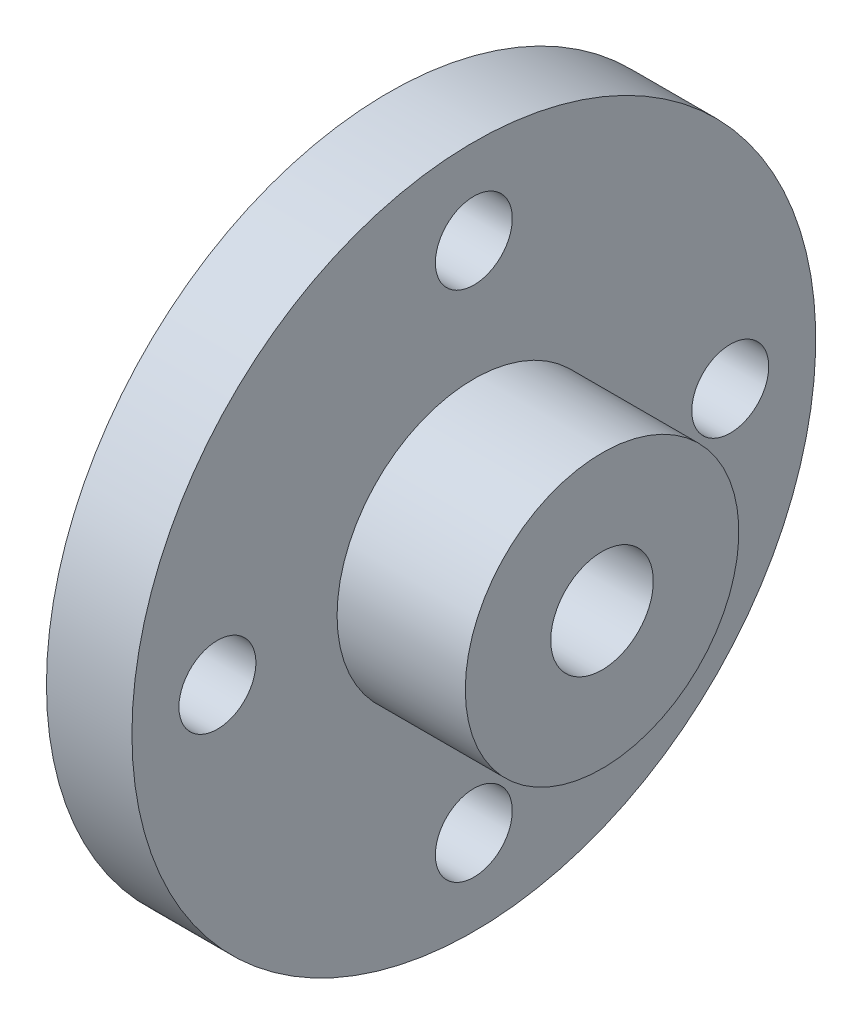
ISO-10303-21;
HEADER;
FILE_DESCRIPTION(('STEP AP214'),'2;1');
FILE_NAME('part.step','',(''),(''),'','','');
FILE_SCHEMA(('AUTOMOTIVE_DESIGN { 1 0 10303 214 1 1 1 1 }'));
ENDSEC;
DATA;
#1=APPLICATION_CONTEXT('core data for automotive mechanical design processes');
#2=APPLICATION_PROTOCOL_DEFINITION('international standard','automotive_design',2000,#1);
#3=PRODUCT_CONTEXT('',#1,'mechanical');
#4=PRODUCT('Part','Part','',(#3));
#5=PRODUCT_RELATED_PRODUCT_CATEGORY('part','',(#4));
#6=PRODUCT_DEFINITION_FORMATION('','',#4);
#7=PRODUCT_DEFINITION_CONTEXT('part definition',#1,'design');
#8=PRODUCT_DEFINITION('design','',#6,#7);
#9=PRODUCT_DEFINITION_SHAPE('','',#8);
#10=(LENGTH_UNIT() NAMED_UNIT(*) SI_UNIT(.MILLI.,.METRE.));
#11=(NAMED_UNIT(*) PLANE_ANGLE_UNIT() SI_UNIT($,.RADIAN.));
#12=(NAMED_UNIT(*) SI_UNIT($,.STERADIAN.) SOLID_ANGLE_UNIT());
#13=UNCERTAINTY_MEASURE_WITH_UNIT(LENGTH_MEASURE(1.E-05),#10,'distance_accuracy_value','');
#14=(GEOMETRIC_REPRESENTATION_CONTEXT(3) GLOBAL_UNCERTAINTY_ASSIGNED_CONTEXT((#13)) GLOBAL_UNIT_ASSIGNED_CONTEXT((#10,
#11,#12)) REPRESENTATION_CONTEXT('',''));
#15=CARTESIAN_POINT('',(0.,0.,0.));
#16=DIRECTION('',(0.,0.,1.));
#17=DIRECTION('',(1.,0.,0.));
#18=AXIS2_PLACEMENT_3D('',#15,#16,#17);
#19=CARTESIAN_POINT('',(-16.9594650205761,0.,0.));
#20=DIRECTION('',(-1.,0.,0.));
#21=DIRECTION('',(0.,0.,1.));
#22=AXIS2_PLACEMENT_3D('',#19,#20,#21);
#23=CYLINDRICAL_SURFACE('',#22,16.);
#24=CARTESIAN_POINT('',(0.,0.,0.));
#25=DIRECTION('',(-1.,0.,0.));
#26=DIRECTION('',(0.,0.,1.));
#27=AXIS2_PLACEMENT_3D('',#24,#25,#26);
#28=CIRCLE('',#27,16.);
#29=CARTESIAN_POINT('',(0.,0.,16.));
#30=VERTEX_POINT('',#29);
#31=EDGE_CURVE('E17',#30,#30,#28,.F.);
#32=ORIENTED_EDGE('',*,*,#31,.T.);
#33=EDGE_LOOP('',(#32));
#34=FACE_BOUND('',#33,.T.);
#35=CARTESIAN_POINT('',(15.,0.,0.));
#36=DIRECTION('',(-1.,0.,0.));
#37=DIRECTION('',(0.,0.,1.));
#38=AXIS2_PLACEMENT_3D('',#35,#36,#37);
#39=CIRCLE('',#38,16.);
#40=CARTESIAN_POINT('',(15.,0.,16.));
#41=VERTEX_POINT('',#40);
#42=EDGE_CURVE('E57',#41,#41,#39,.T.);
#43=ORIENTED_EDGE('',*,*,#42,.T.);
#44=EDGE_LOOP('',(#43));
#45=FACE_BOUND('',#44,.T.);
#46=ADVANCED_FACE('F14',(#34,#45),#23,.T.);
#47=CARTESIAN_POINT('',(0.,40.,0.));
#48=DIRECTION('',(-1.,0.,0.));
#49=DIRECTION('',(0.,0.,1.));
#50=AXIS2_PLACEMENT_3D('',#47,#48,#49);
#51=PLANE('',#50);
#52=CARTESIAN_POINT('',(0.,3.14233320495882E-13,-30.));
#53=DIRECTION('',(-1.,0.,0.));
#54=DIRECTION('',(0.,0.,1.));
#55=AXIS2_PLACEMENT_3D('',#52,#53,#54);
#56=CIRCLE('',#55,4.5);
#57=CARTESIAN_POINT('',(0.,3.14233320495882E-13,-25.5));
#58=VERTEX_POINT('',#57);
#59=EDGE_CURVE('E55',#58,#58,#56,.T.);
#60=ORIENTED_EDGE('',*,*,#59,.T.);
#61=EDGE_LOOP('',(#60));
#62=FACE_BOUND('',#61,.T.);
#63=CARTESIAN_POINT('',(0.,-1.04744440165294E-13,30.));
#64=DIRECTION('',(-1.,0.,0.));
#65=DIRECTION('',(0.,0.,1.));
#66=AXIS2_PLACEMENT_3D('',#63,#64,#65);
#67=CIRCLE('',#66,4.5);
#68=CARTESIAN_POINT('',(0.,-1.04744440165294E-13,34.5));
#69=VERTEX_POINT('',#68);
#70=EDGE_CURVE('E52',#69,#69,#67,.T.);
#71=ORIENTED_EDGE('',*,*,#70,.T.);
#72=EDGE_LOOP('',(#71));
#73=FACE_BOUND('',#72,.T.);
#74=ORIENTED_EDGE('',*,*,#31,.F.);
#75=EDGE_LOOP('',(#74));
#76=FACE_BOUND('',#75,.T.);
#77=CARTESIAN_POINT('',(0.,0.,0.));
#78=DIRECTION('',(-1.,0.,0.));
#79=DIRECTION('',(0.,0.,1.));
#80=AXIS2_PLACEMENT_3D('',#77,#78,#79);
#81=CIRCLE('',#80,40.);
#82=CARTESIAN_POINT('',(0.,0.,40.));
#83=VERTEX_POINT('',#82);
#84=EDGE_CURVE('E49',#83,#83,#81,.T.);
#85=ORIENTED_EDGE('',*,*,#84,.F.);
#86=EDGE_LOOP('',(#85));
#87=FACE_BOUND('',#86,.T.);
#88=CARTESIAN_POINT('',(0.,30.,0.));
#89=DIRECTION('',(-1.,0.,0.));
#90=DIRECTION('',(0.,0.,1.));
#91=AXIS2_PLACEMENT_3D('',#88,#89,#90);
#92=CIRCLE('',#91,4.5);
#93=CARTESIAN_POINT('',(0.,30.,4.5));
#94=VERTEX_POINT('',#93);
#95=EDGE_CURVE('E46',#94,#94,#92,.T.);
#96=ORIENTED_EDGE('',*,*,#95,.T.);
#97=EDGE_LOOP('',(#96));
#98=FACE_BOUND('',#97,.T.);
#99=CARTESIAN_POINT('',(0.,-30.,-2.09488880330588E-13));
#100=DIRECTION('',(-1.,0.,0.));
#101=DIRECTION('',(0.,0.,1.));
#102=AXIS2_PLACEMENT_3D('',#99,#100,#101);
#103=CIRCLE('',#102,4.5);
#104=CARTESIAN_POINT('',(0.,-30.,4.49999999999979));
#105=VERTEX_POINT('',#104);
#106=EDGE_CURVE('E43',#105,#105,#103,.T.);
#107=ORIENTED_EDGE('',*,*,#106,.T.);
#108=EDGE_LOOP('',(#107));
#109=FACE_BOUND('',#108,.T.);
#110=ADVANCED_FACE('F65',(#62,#73,#76,#87,#98,#109),#51,.F.);
#111=CARTESIAN_POINT('',(15.,16.,0.));
#112=DIRECTION('',(-1.,0.,0.));
#113=DIRECTION('',(0.,0.,1.));
#114=AXIS2_PLACEMENT_3D('',#111,#112,#113);
#115=PLANE('',#114);
#116=CARTESIAN_POINT('',(15.,0.,0.));
#117=DIRECTION('',(-1.,0.,0.));
#118=DIRECTION('',(0.,0.,1.));
#119=AXIS2_PLACEMENT_3D('',#116,#117,#118);
#120=CIRCLE('',#119,6.);
#121=CARTESIAN_POINT('',(15.,0.,6.));
#122=VERTEX_POINT('',#121);
#123=EDGE_CURVE('E40',#122,#122,#120,.T.);
#124=ORIENTED_EDGE('',*,*,#123,.T.);
#125=EDGE_LOOP('',(#124));
#126=FACE_BOUND('',#125,.T.);
#127=ORIENTED_EDGE('',*,*,#42,.F.);
#128=EDGE_LOOP('',(#127));
#129=FACE_BOUND('',#128,.T.);
#130=ADVANCED_FACE('F68',(#126,#129),#115,.F.);
#131=CARTESIAN_POINT('',(15.,3.14233320495882E-13,-30.));
#132=DIRECTION('',(-1.,0.,0.));
#133=DIRECTION('',(0.,0.,1.));
#134=AXIS2_PLACEMENT_3D('',#131,#132,#133);
#135=CYLINDRICAL_SURFACE('',#134,4.5);
#136=CARTESIAN_POINT('',(-9.99999999999999,3.14233320495882E-13,-30.));
#137=DIRECTION('',(-1.,0.,0.));
#138=DIRECTION('',(0.,0.,1.));
#139=AXIS2_PLACEMENT_3D('',#136,#137,#138);
#140=CIRCLE('',#139,4.5);
#141=CARTESIAN_POINT('',(-9.99999999999999,3.14233320495882E-13,-25.5));
#142=VERTEX_POINT('',#141);
#143=EDGE_CURVE('E37',#142,#142,#140,.T.);
#144=ORIENTED_EDGE('',*,*,#143,.T.);
#145=EDGE_LOOP('',(#144));
#146=FACE_BOUND('',#145,.T.);
#147=ORIENTED_EDGE('',*,*,#59,.F.);
#148=EDGE_LOOP('',(#147));
#149=FACE_BOUND('',#148,.T.);
#150=ADVANCED_FACE('F109',(#146,#149),#135,.F.);
#151=CARTESIAN_POINT('',(15.,-1.04744440165294E-13,30.));
#152=DIRECTION('',(-1.,0.,0.));
#153=DIRECTION('',(0.,0.,1.));
#154=AXIS2_PLACEMENT_3D('',#151,#152,#153);
#155=CYLINDRICAL_SURFACE('',#154,4.5);
#156=CARTESIAN_POINT('',(-9.99999999999999,-1.04744440165294E-13,30.));
#157=DIRECTION('',(-1.,0.,0.));
#158=DIRECTION('',(0.,0.,1.));
#159=AXIS2_PLACEMENT_3D('',#156,#157,#158);
#160=CIRCLE('',#159,4.5);
#161=CARTESIAN_POINT('',(-9.99999999999999,-1.04744440165294E-13,34.5));
#162=VERTEX_POINT('',#161);
#163=EDGE_CURVE('E34',#162,#162,#160,.T.);
#164=ORIENTED_EDGE('',*,*,#163,.T.);
#165=EDGE_LOOP('',(#164));
#166=FACE_BOUND('',#165,.T.);
#167=ORIENTED_EDGE('',*,*,#70,.F.);
#168=EDGE_LOOP('',(#167));
#169=FACE_BOUND('',#168,.T.);
#170=ADVANCED_FACE('F112',(#166,#169),#155,.F.);
#171=CARTESIAN_POINT('',(-16.9594650205761,0.,0.));
#172=DIRECTION('',(-1.,0.,0.));
#173=DIRECTION('',(0.,0.,1.));
#174=AXIS2_PLACEMENT_3D('',#171,#172,#173);
#175=CYLINDRICAL_SURFACE('',#174,40.);
#176=CARTESIAN_POINT('',(-9.99999999999999,0.,0.));
#177=DIRECTION('',(-1.,0.,0.));
#178=DIRECTION('',(0.,0.,1.));
#179=AXIS2_PLACEMENT_3D('',#176,#177,#178);
#180=CIRCLE('',#179,40.);
#181=CARTESIAN_POINT('',(-9.99999999999999,0.,40.));
#182=VERTEX_POINT('',#181);
#183=EDGE_CURVE('E31',#182,#182,#180,.F.);
#184=ORIENTED_EDGE('',*,*,#183,.T.);
#185=EDGE_LOOP('',(#184));
#186=FACE_BOUND('',#185,.T.);
#187=ORIENTED_EDGE('',*,*,#84,.T.);
#188=EDGE_LOOP('',(#187));
#189=FACE_BOUND('',#188,.T.);
#190=ADVANCED_FACE('F90',(#186,#189),#175,.T.);
#191=CARTESIAN_POINT('',(15.,30.,0.));
#192=DIRECTION('',(-1.,0.,0.));
#193=DIRECTION('',(0.,0.,1.));
#194=AXIS2_PLACEMENT_3D('',#191,#192,#193);
#195=CYLINDRICAL_SURFACE('',#194,4.5);
#196=CARTESIAN_POINT('',(-9.99999999999999,30.,0.));
#197=DIRECTION('',(-1.,0.,0.));
#198=DIRECTION('',(0.,0.,1.));
#199=AXIS2_PLACEMENT_3D('',#196,#197,#198);
#200=CIRCLE('',#199,4.5);
#201=CARTESIAN_POINT('',(-9.99999999999999,30.,4.5));
#202=VERTEX_POINT('',#201);
#203=EDGE_CURVE('E26',#202,#202,#200,.T.);
#204=ORIENTED_EDGE('',*,*,#203,.T.);
#205=EDGE_LOOP('',(#204));
#206=FACE_BOUND('',#205,.T.);
#207=ORIENTED_EDGE('',*,*,#95,.F.);
#208=EDGE_LOOP('',(#207));
#209=FACE_BOUND('',#208,.T.);
#210=ADVANCED_FACE('F79',(#206,#209),#195,.F.);
#211=CARTESIAN_POINT('',(15.,-30.,-2.09488880330588E-13));
#212=DIRECTION('',(-1.,0.,0.));
#213=DIRECTION('',(0.,0.,1.));
#214=AXIS2_PLACEMENT_3D('',#211,#212,#213);
#215=CYLINDRICAL_SURFACE('',#214,4.5);
#216=CARTESIAN_POINT('',(-9.99999999999999,-30.,-2.09488880330588E-13));
#217=DIRECTION('',(-1.,0.,0.));
#218=DIRECTION('',(0.,0.,1.));
#219=AXIS2_PLACEMENT_3D('',#216,#217,#218);
#220=CIRCLE('',#219,4.5);
#221=CARTESIAN_POINT('',(-9.99999999999999,-30.,4.49999999999979));
#222=VERTEX_POINT('',#221);
#223=EDGE_CURVE('E21',#222,#222,#220,.T.);
#224=ORIENTED_EDGE('',*,*,#223,.T.);
#225=EDGE_LOOP('',(#224));
#226=FACE_BOUND('',#225,.T.);
#227=ORIENTED_EDGE('',*,*,#106,.F.);
#228=EDGE_LOOP('',(#227));
#229=FACE_BOUND('',#228,.T.);
#230=ADVANCED_FACE('F76',(#226,#229),#215,.F.);
#231=CARTESIAN_POINT('',(-9.48503389009925,0.,0.));
#232=DIRECTION('',(-1.,0.,0.));
#233=DIRECTION('',(0.,0.,1.));
#234=AXIS2_PLACEMENT_3D('',#231,#232,#233);
#235=CYLINDRICAL_SURFACE('',#234,6.);
#236=ORIENTED_EDGE('',*,*,#123,.F.);
#237=EDGE_LOOP('',(#236));
#238=FACE_BOUND('',#237,.T.);
#239=CARTESIAN_POINT('',(-9.99999999999999,0.,0.));
#240=DIRECTION('',(-1.,0.,0.));
#241=DIRECTION('',(0.,0.,1.));
#242=AXIS2_PLACEMENT_3D('',#239,#240,#241);
#243=CIRCLE('',#242,6.);
#244=CARTESIAN_POINT('',(-9.99999999999999,0.,6.));
#245=VERTEX_POINT('',#244);
#246=EDGE_CURVE('E10',#245,#245,#243,.T.);
#247=ORIENTED_EDGE('',*,*,#246,.T.);
#248=EDGE_LOOP('',(#247));
#249=FACE_BOUND('',#248,.T.);
#250=ADVANCED_FACE('F78',(#238,#249),#235,.F.);
#251=CARTESIAN_POINT('',(-9.99999999999999,0.,0.));
#252=DIRECTION('',(1.,0.,0.));
#253=DIRECTION('',(0.,0.,-1.));
#254=AXIS2_PLACEMENT_3D('',#251,#252,#253);
#255=PLANE('',#254);
#256=ORIENTED_EDGE('',*,*,#246,.F.);
#257=EDGE_LOOP('',(#256));
#258=FACE_BOUND('',#257,.T.);
#259=ORIENTED_EDGE('',*,*,#223,.F.);
#260=EDGE_LOOP('',(#259));
#261=FACE_BOUND('',#260,.T.);
#262=ORIENTED_EDGE('',*,*,#203,.F.);
#263=EDGE_LOOP('',(#262));
#264=FACE_BOUND('',#263,.T.);
#265=ORIENTED_EDGE('',*,*,#183,.F.);
#266=EDGE_LOOP('',(#265));
#267=FACE_BOUND('',#266,.T.);
#268=ORIENTED_EDGE('',*,*,#163,.F.);
#269=EDGE_LOOP('',(#268));
#270=FACE_BOUND('',#269,.T.);
#271=ORIENTED_EDGE('',*,*,#143,.F.);
#272=EDGE_LOOP('',(#271));
#273=FACE_BOUND('',#272,.T.);
#274=ADVANCED_FACE('F87',(#258,#261,#264,#267,#270,#273),#255,.F.);
#275=CLOSED_SHELL('',(#46,#110,#130,#150,#170,#190,#210,#230,#250,#274));
#276=MANIFOLD_SOLID_BREP('B1',#275);
#277=ADVANCED_BREP_SHAPE_REPRESENTATION('',(#18,#276),#14);
#278=SHAPE_DEFINITION_REPRESENTATION(#9,#277);
ENDSEC;
END-ISO-10303-21;
